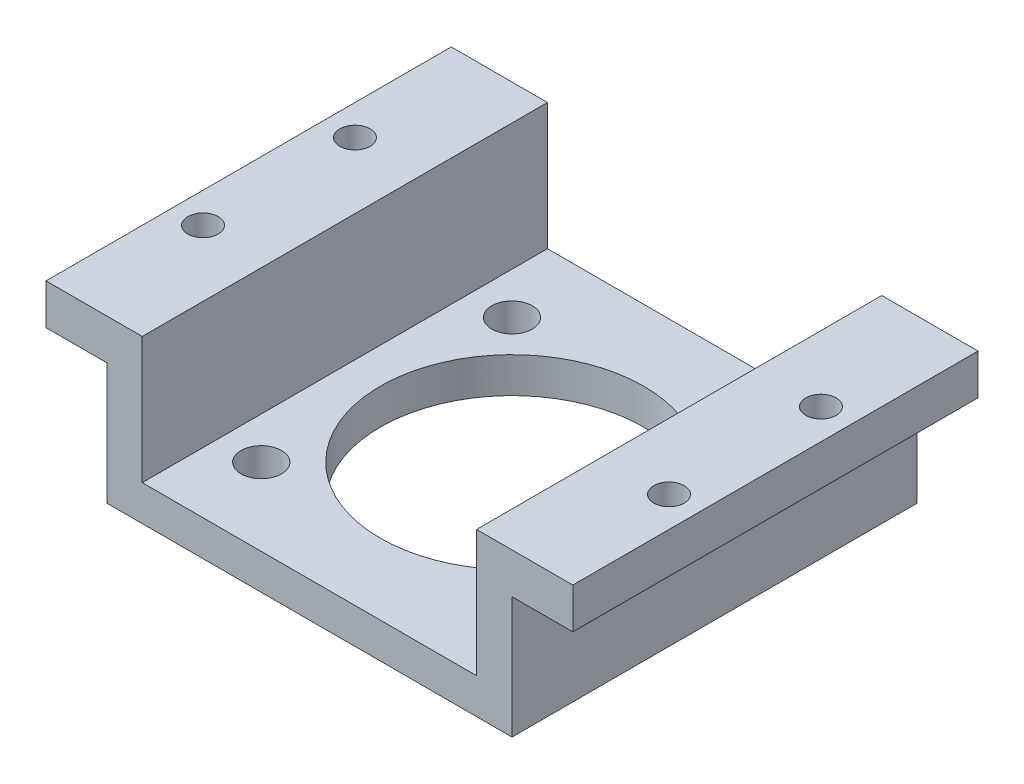
ISO-10303-21;
HEADER;
FILE_DESCRIPTION(('STEP AP214'),'2;1');
FILE_NAME('part.step','',(''),(''),'','','');
FILE_SCHEMA(('AUTOMOTIVE_DESIGN { 1 0 10303 214 1 1 1 1 }'));
ENDSEC;
DATA;
#1=APPLICATION_CONTEXT('core data for automotive mechanical design processes');
#2=APPLICATION_PROTOCOL_DEFINITION('international standard','automotive_design',2000,#1);
#3=PRODUCT_CONTEXT('',#1,'mechanical');
#4=PRODUCT('Part','Part','',(#3));
#5=PRODUCT_RELATED_PRODUCT_CATEGORY('part','',(#4));
#6=PRODUCT_DEFINITION_FORMATION('','',#4);
#7=PRODUCT_DEFINITION_CONTEXT('part definition',#1,'design');
#8=PRODUCT_DEFINITION('design','',#6,#7);
#9=PRODUCT_DEFINITION_SHAPE('','',#8);
#10=(LENGTH_UNIT() NAMED_UNIT(*) SI_UNIT(.MILLI.,.METRE.));
#11=(NAMED_UNIT(*) PLANE_ANGLE_UNIT() SI_UNIT($,.RADIAN.));
#12=(NAMED_UNIT(*) SI_UNIT($,.STERADIAN.) SOLID_ANGLE_UNIT());
#13=UNCERTAINTY_MEASURE_WITH_UNIT(LENGTH_MEASURE(1.E-05),#10,'distance_accuracy_value','');
#14=(GEOMETRIC_REPRESENTATION_CONTEXT(3) GLOBAL_UNCERTAINTY_ASSIGNED_CONTEXT((#13)) GLOBAL_UNIT_ASSIGNED_CONTEXT((#10,
#11,#12)) REPRESENTATION_CONTEXT('',''));
#15=CARTESIAN_POINT('',(0.,0.,0.));
#16=DIRECTION('',(0.,0.,1.));
#17=DIRECTION('',(1.,0.,0.));
#18=AXIS2_PLACEMENT_3D('',#15,#16,#17);
#19=CARTESIAN_POINT('',(26.,27.3987856394065,40.));
#20=DIRECTION('',(-1.,0.,0.));
#21=DIRECTION('',(0.,-1.,0.));
#22=AXIS2_PLACEMENT_3D('',#19,#20,#21);
#23=PLANE('',#22);
#24=DIRECTION('',(0.,0.,1.));
#25=VECTOR('',#24,1.);
#26=CARTESIAN_POINT('',(26.,23.3987856394065,0.));
#27=LINE('',#26,#25);
#28=CARTESIAN_POINT('',(26.,23.3987856394065,0.));
#29=VERTEX_POINT('',#28);
#30=CARTESIAN_POINT('',(26.,23.3987856394065,40.));
#31=VERTEX_POINT('',#30);
#32=EDGE_CURVE('E137',#29,#31,#27,.T.);
#33=ORIENTED_EDGE('',*,*,#32,.F.);
#34=DIRECTION('',(0.,1.,0.));
#35=VECTOR('',#34,1.);
#36=CARTESIAN_POINT('',(26.,27.3987856394065,0.));
#37=LINE('',#36,#35);
#38=CARTESIAN_POINT('',(26.,27.3987856394065,0.));
#39=VERTEX_POINT('',#38);
#40=EDGE_CURVE('E147',#29,#39,#37,.T.);
#41=ORIENTED_EDGE('',*,*,#40,.T.);
#42=DIRECTION('',(0.,0.,-1.));
#43=VECTOR('',#42,1.);
#44=CARTESIAN_POINT('',(26.,27.3987856394065,40.));
#45=LINE('',#44,#43);
#46=CARTESIAN_POINT('',(26.,27.3987856394065,40.));
#47=VERTEX_POINT('',#46);
#48=EDGE_CURVE('E191',#47,#39,#45,.T.);
#49=ORIENTED_EDGE('',*,*,#48,.F.);
#50=DIRECTION('',(0.,1.,0.));
#51=VECTOR('',#50,1.);
#52=CARTESIAN_POINT('',(26.,27.3987856394065,40.));
#53=LINE('',#52,#51);
#54=EDGE_CURVE('E149',#31,#47,#53,.T.);
#55=ORIENTED_EDGE('',*,*,#54,.F.);
#56=EDGE_LOOP('',(#33,#41,#49,#55));
#57=FACE_BOUND('',#56,.T.);
#58=ADVANCED_FACE('F40',(#57),#23,.F.);
#59=CARTESIAN_POINT('',(23.,27.3987856394065,27.5));
#60=DIRECTION('',(0.,-1.,0.));
#61=DIRECTION('',(1.,0.,0.));
#62=AXIS2_PLACEMENT_3D('',#59,#60,#61);
#63=CYLINDRICAL_SURFACE('',#62,1.5);
#64=CARTESIAN_POINT('',(23.,27.3987856394065,27.5));
#65=DIRECTION('',(0.,1.,0.));
#66=DIRECTION('',(0.,0.,-1.));
#67=AXIS2_PLACEMENT_3D('',#64,#65,#66);
#68=CIRCLE('',#67,1.5);
#69=CARTESIAN_POINT('',(23.,27.3987856394065,26.));
#70=VERTEX_POINT('',#69);
#71=EDGE_CURVE('E257',#70,#70,#68,.T.);
#72=ORIENTED_EDGE('',*,*,#71,.T.);
#73=EDGE_LOOP('',(#72));
#74=FACE_BOUND('',#73,.T.);
#75=CARTESIAN_POINT('',(23.,23.3987856394065,27.5));
#76=DIRECTION('',(0.,-1.,0.));
#77=DIRECTION('',(0.,0.,-1.));
#78=AXIS2_PLACEMENT_3D('',#75,#76,#77);
#79=CIRCLE('',#78,1.5);
#80=CARTESIAN_POINT('',(23.,23.3987856394065,26.));
#81=VERTEX_POINT('',#80);
#82=EDGE_CURVE('E374',#81,#81,#79,.T.);
#83=ORIENTED_EDGE('',*,*,#82,.T.);
#84=EDGE_LOOP('',(#83));
#85=FACE_BOUND('',#84,.T.);
#86=ADVANCED_FACE('F368',(#74,#85),#63,.F.);
#87=CARTESIAN_POINT('',(23.,27.3987856394065,12.5));
#88=DIRECTION('',(0.,-1.,0.));
#89=DIRECTION('',(1.,0.,0.));
#90=AXIS2_PLACEMENT_3D('',#87,#88,#89);
#91=CYLINDRICAL_SURFACE('',#90,1.5);
#92=CARTESIAN_POINT('',(23.,27.3987856394065,12.5));
#93=DIRECTION('',(0.,1.,0.));
#94=DIRECTION('',(0.,0.,-1.));
#95=AXIS2_PLACEMENT_3D('',#92,#93,#94);
#96=CIRCLE('',#95,1.5);
#97=CARTESIAN_POINT('',(23.,27.3987856394065,11.));
#98=VERTEX_POINT('',#97);
#99=EDGE_CURVE('E253',#98,#98,#96,.T.);
#100=ORIENTED_EDGE('',*,*,#99,.T.);
#101=EDGE_LOOP('',(#100));
#102=FACE_BOUND('',#101,.T.);
#103=CARTESIAN_POINT('',(23.,23.3987856394065,12.5));
#104=DIRECTION('',(0.,-1.,0.));
#105=DIRECTION('',(0.,0.,-1.));
#106=AXIS2_PLACEMENT_3D('',#103,#104,#105);
#107=CIRCLE('',#106,1.5);
#108=CARTESIAN_POINT('',(23.,23.3987856394065,11.));
#109=VERTEX_POINT('',#108);
#110=EDGE_CURVE('E44',#109,#109,#107,.T.);
#111=ORIENTED_EDGE('',*,*,#110,.T.);
#112=EDGE_LOOP('',(#111));
#113=FACE_BOUND('',#112,.T.);
#114=ADVANCED_FACE('F365',(#102,#113),#91,.F.);
#115=CARTESIAN_POINT('',(-26.,27.3987856394065,40.));
#116=DIRECTION('',(1.,0.,0.));
#117=DIRECTION('',(0.,0.,-1.));
#118=AXIS2_PLACEMENT_3D('',#115,#116,#117);
#119=PLANE('',#118);
#120=DIRECTION('',(0.,0.,-1.));
#121=VECTOR('',#120,1.);
#122=CARTESIAN_POINT('',(-26.,23.3987856394065,40.));
#123=LINE('',#122,#121);
#124=CARTESIAN_POINT('',(-26.,23.3987856394065,40.));
#125=VERTEX_POINT('',#124);
#126=CARTESIAN_POINT('',(-26.,23.3987856394065,0.));
#127=VERTEX_POINT('',#126);
#128=EDGE_CURVE('E66',#125,#127,#123,.T.);
#129=ORIENTED_EDGE('',*,*,#128,.F.);
#130=DIRECTION('',(0.,-1.,0.));
#131=VECTOR('',#130,1.);
#132=CARTESIAN_POINT('',(-26.,27.3987856394065,40.));
#133=LINE('',#132,#131);
#134=CARTESIAN_POINT('',(-26.,27.3987856394065,40.));
#135=VERTEX_POINT('',#134);
#136=EDGE_CURVE('E177',#135,#125,#133,.T.);
#137=ORIENTED_EDGE('',*,*,#136,.F.);
#138=DIRECTION('',(0.,0.,-1.));
#139=VECTOR('',#138,1.);
#140=CARTESIAN_POINT('',(-26.,27.3987856394065,40.));
#141=LINE('',#140,#139);
#142=CARTESIAN_POINT('',(-26.,27.3987856394065,0.));
#143=VERTEX_POINT('',#142);
#144=EDGE_CURVE('E178',#135,#143,#141,.T.);
#145=ORIENTED_EDGE('',*,*,#144,.T.);
#146=DIRECTION('',(0.,-1.,0.));
#147=VECTOR('',#146,1.);
#148=CARTESIAN_POINT('',(-26.,27.3987856394065,0.));
#149=LINE('',#148,#147);
#150=EDGE_CURVE('E288',#143,#127,#149,.T.);
#151=ORIENTED_EDGE('',*,*,#150,.T.);
#152=EDGE_LOOP('',(#129,#137,#145,#151));
#153=FACE_BOUND('',#152,.T.);
#154=ADVANCED_FACE('F42',(#153),#119,.F.);
#155=CARTESIAN_POINT('',(-23.,27.3987856394065,27.5));
#156=DIRECTION('',(0.,-1.,0.));
#157=DIRECTION('',(0.,0.,-1.));
#158=AXIS2_PLACEMENT_3D('',#155,#156,#157);
#159=CYLINDRICAL_SURFACE('',#158,1.5);
#160=CARTESIAN_POINT('',(-23.,27.3987856394065,27.5));
#161=DIRECTION('',(0.,-1.,0.));
#162=DIRECTION('',(0.,0.,-1.));
#163=AXIS2_PLACEMENT_3D('',#160,#161,#162);
#164=CIRCLE('',#163,1.5);
#165=CARTESIAN_POINT('',(-23.,27.3987856394065,26.));
#166=VERTEX_POINT('',#165);
#167=EDGE_CURVE('E265',#166,#166,#164,.T.);
#168=ORIENTED_EDGE('',*,*,#167,.F.);
#169=EDGE_LOOP('',(#168));
#170=FACE_BOUND('',#169,.T.);
#171=CARTESIAN_POINT('',(-23.,23.3987856394065,27.5));
#172=DIRECTION('',(0.,-1.,0.));
#173=DIRECTION('',(0.,0.,-1.));
#174=AXIS2_PLACEMENT_3D('',#171,#172,#173);
#175=CIRCLE('',#174,1.5);
#176=CARTESIAN_POINT('',(-23.,23.3987856394065,26.));
#177=VERTEX_POINT('',#176);
#178=EDGE_CURVE('E204',#177,#177,#175,.F.);
#179=ORIENTED_EDGE('',*,*,#178,.F.);
#180=EDGE_LOOP('',(#179));
#181=FACE_BOUND('',#180,.T.);
#182=ADVANCED_FACE('F503',(#170,#181),#159,.F.);
#183=CARTESIAN_POINT('',(-23.,27.3987856394065,12.5));
#184=DIRECTION('',(0.,-1.,0.));
#185=DIRECTION('',(0.,0.,-1.));
#186=AXIS2_PLACEMENT_3D('',#183,#184,#185);
#187=CYLINDRICAL_SURFACE('',#186,1.5);
#188=CARTESIAN_POINT('',(-23.,27.3987856394065,12.5));
#189=DIRECTION('',(0.,-1.,0.));
#190=DIRECTION('',(0.,0.,-1.));
#191=AXIS2_PLACEMENT_3D('',#188,#189,#190);
#192=CIRCLE('',#191,1.5);
#193=CARTESIAN_POINT('',(-23.,27.3987856394065,11.));
#194=VERTEX_POINT('',#193);
#195=EDGE_CURVE('E261',#194,#194,#192,.T.);
#196=ORIENTED_EDGE('',*,*,#195,.F.);
#197=EDGE_LOOP('',(#196));
#198=FACE_BOUND('',#197,.T.);
#199=CARTESIAN_POINT('',(-23.,23.3987856394065,12.5));
#200=DIRECTION('',(0.,-1.,0.));
#201=DIRECTION('',(0.,0.,-1.));
#202=AXIS2_PLACEMENT_3D('',#199,#200,#201);
#203=CIRCLE('',#202,1.5);
#204=CARTESIAN_POINT('',(-23.,23.3987856394065,11.));
#205=VERTEX_POINT('',#204);
#206=EDGE_CURVE('E201',#205,#205,#203,.F.);
#207=ORIENTED_EDGE('',*,*,#206,.F.);
#208=EDGE_LOOP('',(#207));
#209=FACE_BOUND('',#208,.T.);
#210=ADVANCED_FACE('F511',(#198,#209),#187,.F.);
#211=CARTESIAN_POINT('',(0.,12.8987856394065,20.));
#212=DIRECTION('',(0.,-1.,0.));
#213=DIRECTION('',(0.,0.,-1.));
#214=AXIS2_PLACEMENT_3D('',#211,#212,#213);
#215=CYLINDRICAL_SURFACE('',#214,13.);
#216=CARTESIAN_POINT('',(0.,11.3987856394065,20.));
#217=DIRECTION('',(0.,-1.,0.));
#218=DIRECTION('',(0.,0.,-1.));
#219=AXIS2_PLACEMENT_3D('',#216,#217,#218);
#220=CIRCLE('',#219,13.);
#221=CARTESIAN_POINT('',(0.,11.3987856394065,7.));
#222=VERTEX_POINT('',#221);
#223=EDGE_CURVE('E284',#222,#222,#220,.T.);
#224=ORIENTED_EDGE('',*,*,#223,.T.);
#225=EDGE_LOOP('',(#224));
#226=FACE_BOUND('',#225,.T.);
#227=CARTESIAN_POINT('',(0.,14.8987856394065,20.));
#228=DIRECTION('',(0.,1.,0.));
#229=DIRECTION('',(0.,0.,1.));
#230=AXIS2_PLACEMENT_3D('',#227,#228,#229);
#231=CIRCLE('',#230,13.);
#232=CARTESIAN_POINT('',(0.,14.8987856394065,33.));
#233=VERTEX_POINT('',#232);
#234=EDGE_CURVE('E249',#233,#233,#231,.F.);
#235=ORIENTED_EDGE('',*,*,#234,.F.);
#236=EDGE_LOOP('',(#235));
#237=FACE_BOUND('',#236,.T.);
#238=ADVANCED_FACE('F520',(#226,#237),#215,.F.);
#239=CARTESIAN_POINT('',(12.3743686707646,27.3997856394065,32.3743686707646));
#240=DIRECTION('',(0.,-1.,0.));
#241=DIRECTION('',(0.,0.,-1.));
#242=AXIS2_PLACEMENT_3D('',#239,#240,#241);
#243=CYLINDRICAL_SURFACE('',#242,2.);
#244=CARTESIAN_POINT('',(12.3743686707646,11.3987856394065,32.3743686707646));
#245=DIRECTION('',(0.,-1.,0.));
#246=DIRECTION('',(0.,0.,-1.));
#247=AXIS2_PLACEMENT_3D('',#244,#245,#246);
#248=CIRCLE('',#247,2.);
#249=CARTESIAN_POINT('',(12.3743686707646,11.3987856394065,30.3743686707646));
#250=VERTEX_POINT('',#249);
#251=EDGE_CURVE('E280',#250,#250,#248,.T.);
#252=ORIENTED_EDGE('',*,*,#251,.T.);
#253=EDGE_LOOP('',(#252));
#254=FACE_BOUND('',#253,.T.);
#255=CARTESIAN_POINT('',(12.3743686707646,14.8987856394065,32.3743686707646));
#256=DIRECTION('',(0.,1.,0.));
#257=DIRECTION('',(0.,0.,1.));
#258=AXIS2_PLACEMENT_3D('',#255,#256,#257);
#259=CIRCLE('',#258,2.);
#260=CARTESIAN_POINT('',(12.3743686707646,14.8987856394065,34.3743686707646));
#261=VERTEX_POINT('',#260);
#262=EDGE_CURVE('E245',#261,#261,#259,.F.);
#263=ORIENTED_EDGE('',*,*,#262,.F.);
#264=EDGE_LOOP('',(#263));
#265=FACE_BOUND('',#264,.T.);
#266=ADVANCED_FACE('F549',(#254,#265),#243,.F.);
#267=CARTESIAN_POINT('',(12.3743686707645,27.3997856394065,7.62563132923535));
#268=DIRECTION('',(0.,-1.,0.));
#269=DIRECTION('',(0.,0.,-1.));
#270=AXIS2_PLACEMENT_3D('',#267,#268,#269);
#271=CYLINDRICAL_SURFACE('',#270,2.);
#272=CARTESIAN_POINT('',(12.3743686707645,11.3987856394065,7.62563132923535));
#273=DIRECTION('',(0.,-1.,0.));
#274=DIRECTION('',(-1.,0.,0.));
#275=AXIS2_PLACEMENT_3D('',#272,#273,#274);
#276=CIRCLE('',#275,2.);
#277=CARTESIAN_POINT('',(10.3743686707645,11.3987856394065,7.62563132923536));
#278=VERTEX_POINT('',#277);
#279=EDGE_CURVE('E277',#278,#278,#276,.T.);
#280=ORIENTED_EDGE('',*,*,#279,.T.);
#281=EDGE_LOOP('',(#280));
#282=FACE_BOUND('',#281,.T.);
#283=CARTESIAN_POINT('',(12.3743686707645,14.8987856394065,7.62563132923535));
#284=DIRECTION('',(0.,1.,0.));
#285=DIRECTION('',(0.,0.,1.));
#286=AXIS2_PLACEMENT_3D('',#283,#284,#285);
#287=CIRCLE('',#286,2.);
#288=CARTESIAN_POINT('',(12.3743686707645,14.8987856394065,9.62563132923535));
#289=VERTEX_POINT('',#288);
#290=EDGE_CURVE('E241',#289,#289,#287,.F.);
#291=ORIENTED_EDGE('',*,*,#290,.F.);
#292=EDGE_LOOP('',(#291));
#293=FACE_BOUND('',#292,.T.);
#294=ADVANCED_FACE('F565',(#282,#293),#271,.F.);
#295=CARTESIAN_POINT('',(-12.3743686707646,27.3997856394065,7.62563132923544));
#296=DIRECTION('',(0.,-1.,0.));
#297=DIRECTION('',(0.,0.,-1.));
#298=AXIS2_PLACEMENT_3D('',#295,#296,#297);
#299=CYLINDRICAL_SURFACE('',#298,2.);
#300=CARTESIAN_POINT('',(-12.3743686707646,11.3987856394065,7.62563132923544));
#301=DIRECTION('',(0.,-1.,0.));
#302=DIRECTION('',(0.,0.,1.));
#303=AXIS2_PLACEMENT_3D('',#300,#301,#302);
#304=CIRCLE('',#303,2.);
#305=CARTESIAN_POINT('',(-12.3743686707646,11.3987856394065,9.62563132923544));
#306=VERTEX_POINT('',#305);
#307=EDGE_CURVE('E273',#306,#306,#304,.T.);
#308=ORIENTED_EDGE('',*,*,#307,.T.);
#309=EDGE_LOOP('',(#308));
#310=FACE_BOUND('',#309,.T.);
#311=CARTESIAN_POINT('',(-12.3743686707646,14.8987856394065,7.62563132923544));
#312=DIRECTION('',(0.,1.,0.));
#313=DIRECTION('',(0.,0.,1.));
#314=AXIS2_PLACEMENT_3D('',#311,#312,#313);
#315=CIRCLE('',#314,2.);
#316=CARTESIAN_POINT('',(-12.3743686707646,14.8987856394065,9.62563132923544));
#317=VERTEX_POINT('',#316);
#318=EDGE_CURVE('E199',#317,#317,#315,.F.);
#319=ORIENTED_EDGE('',*,*,#318,.F.);
#320=EDGE_LOOP('',(#319));
#321=FACE_BOUND('',#320,.T.);
#322=ADVANCED_FACE('F575',(#310,#321),#299,.F.);
#323=CARTESIAN_POINT('',(-12.3743686707644,27.3997856394065,32.3743686707647));
#324=DIRECTION('',(0.,-1.,0.));
#325=DIRECTION('',(0.,0.,-1.));
#326=AXIS2_PLACEMENT_3D('',#323,#324,#325);
#327=CYLINDRICAL_SURFACE('',#326,2.);
#328=CARTESIAN_POINT('',(-12.3743686707644,11.3987856394065,32.3743686707647));
#329=DIRECTION('',(0.,-1.,0.));
#330=DIRECTION('',(1.,0.,0.));
#331=AXIS2_PLACEMENT_3D('',#328,#329,#330);
#332=CIRCLE('',#331,2.);
#333=CARTESIAN_POINT('',(-10.3743686707644,11.3987856394065,32.3743686707647));
#334=VERTEX_POINT('',#333);
#335=EDGE_CURVE('E269',#334,#334,#332,.T.);
#336=ORIENTED_EDGE('',*,*,#335,.T.);
#337=EDGE_LOOP('',(#336));
#338=FACE_BOUND('',#337,.T.);
#339=CARTESIAN_POINT('',(-12.3743686707644,14.8987856394065,32.3743686707647));
#340=DIRECTION('',(0.,1.,0.));
#341=DIRECTION('',(0.,0.,1.));
#342=AXIS2_PLACEMENT_3D('',#339,#340,#341);
#343=CIRCLE('',#342,2.);
#344=CARTESIAN_POINT('',(-12.3743686707644,14.8987856394065,34.3743686707647));
#345=VERTEX_POINT('',#344);
#346=EDGE_CURVE('E196',#345,#345,#343,.F.);
#347=ORIENTED_EDGE('',*,*,#346,.F.);
#348=EDGE_LOOP('',(#347));
#349=FACE_BOUND('',#348,.T.);
#350=ADVANCED_FACE('F360',(#338,#349),#327,.F.);
#351=CARTESIAN_POINT('',(16.5,27.3987856394065,40.));
#352=DIRECTION('',(0.,-1.,0.));
#353=DIRECTION('',(0.,0.,-1.));
#354=AXIS2_PLACEMENT_3D('',#351,#352,#353);
#355=PLANE('',#354);
#356=ORIENTED_EDGE('',*,*,#71,.F.);
#357=EDGE_LOOP('',(#356));
#358=FACE_BOUND('',#357,.T.);
#359=DIRECTION('',(-1.,0.,0.));
#360=VECTOR('',#359,1.);
#361=CARTESIAN_POINT('',(16.5,27.3987856394065,0.));
#362=LINE('',#361,#360);
#363=CARTESIAN_POINT('',(16.5,27.3987856394065,0.));
#364=VERTEX_POINT('',#363);
#365=EDGE_CURVE('E156',#39,#364,#362,.T.);
#366=ORIENTED_EDGE('',*,*,#365,.T.);
#367=DIRECTION('',(0.,0.,-1.));
#368=VECTOR('',#367,1.);
#369=CARTESIAN_POINT('',(16.5,27.3987856394065,40.));
#370=LINE('',#369,#368);
#371=CARTESIAN_POINT('',(16.5,27.3987856394065,40.));
#372=VERTEX_POINT('',#371);
#373=EDGE_CURVE('E187',#372,#364,#370,.T.);
#374=ORIENTED_EDGE('',*,*,#373,.F.);
#375=DIRECTION('',(-1.,0.,0.));
#376=VECTOR('',#375,1.);
#377=CARTESIAN_POINT('',(16.5,27.3987856394065,40.));
#378=LINE('',#377,#376);
#379=EDGE_CURVE('E303',#47,#372,#378,.T.);
#380=ORIENTED_EDGE('',*,*,#379,.F.);
#381=ORIENTED_EDGE('',*,*,#48,.T.);
#382=EDGE_LOOP('',(#366,#374,#380,#381));
#383=FACE_BOUND('',#382,.T.);
#384=ORIENTED_EDGE('',*,*,#99,.F.);
#385=EDGE_LOOP('',(#384));
#386=FACE_BOUND('',#385,.T.);
#387=ADVANCED_FACE('F357',(#358,#383,#386),#355,.F.);
#388=CARTESIAN_POINT('',(-20.,21.3987856394065,40.));
#389=DIRECTION('',(1.,0.,0.));
#390=DIRECTION('',(0.,0.,-1.));
#391=AXIS2_PLACEMENT_3D('',#388,#389,#390);
#392=PLANE('',#391);
#393=DIRECTION('',(0.,-1.,0.));
#394=VECTOR('',#393,1.);
#395=CARTESIAN_POINT('',(-20.,21.3987856394065,0.));
#396=LINE('',#395,#394);
#397=CARTESIAN_POINT('',(-20.,23.3987856394065,0.));
#398=VERTEX_POINT('',#397);
#399=CARTESIAN_POINT('',(-20.,11.3987856394065,0.));
#400=VERTEX_POINT('',#399);
#401=EDGE_CURVE('E316',#398,#400,#396,.T.);
#402=ORIENTED_EDGE('',*,*,#401,.T.);
#403=DIRECTION('',(0.,0.,-1.));
#404=VECTOR('',#403,1.);
#405=CARTESIAN_POINT('',(-20.,11.3987856394065,40.));
#406=LINE('',#405,#404);
#407=CARTESIAN_POINT('',(-20.,11.3987856394065,40.));
#408=VERTEX_POINT('',#407);
#409=EDGE_CURVE('E11',#408,#400,#406,.T.);
#410=ORIENTED_EDGE('',*,*,#409,.F.);
#411=DIRECTION('',(0.,-1.,0.));
#412=VECTOR('',#411,1.);
#413=CARTESIAN_POINT('',(-20.,21.3987856394065,40.));
#414=LINE('',#413,#412);
#415=CARTESIAN_POINT('',(-20.,23.3987856394065,40.));
#416=VERTEX_POINT('',#415);
#417=EDGE_CURVE('E292',#416,#408,#414,.T.);
#418=ORIENTED_EDGE('',*,*,#417,.F.);
#419=DIRECTION('',(0.,0.,1.));
#420=VECTOR('',#419,1.);
#421=CARTESIAN_POINT('',(-20.,23.3987856394065,0.));
#422=LINE('',#421,#420);
#423=EDGE_CURVE('E215',#398,#416,#422,.T.);
#424=ORIENTED_EDGE('',*,*,#423,.F.);
#425=EDGE_LOOP('',(#402,#410,#418,#424));
#426=FACE_BOUND('',#425,.T.);
#427=ADVANCED_FACE('F331',(#426),#392,.F.);
#428=CARTESIAN_POINT('',(-20.,11.3987856394065,40.));
#429=DIRECTION('',(0.,1.,0.));
#430=DIRECTION('',(0.,0.,1.));
#431=AXIS2_PLACEMENT_3D('',#428,#429,#430);
#432=PLANE('',#431);
#433=ORIENTED_EDGE('',*,*,#335,.F.);
#434=EDGE_LOOP('',(#433));
#435=FACE_BOUND('',#434,.T.);
#436=ORIENTED_EDGE('',*,*,#307,.F.);
#437=EDGE_LOOP('',(#436));
#438=FACE_BOUND('',#437,.T.);
#439=ORIENTED_EDGE('',*,*,#279,.F.);
#440=EDGE_LOOP('',(#439));
#441=FACE_BOUND('',#440,.T.);
#442=ORIENTED_EDGE('',*,*,#251,.F.);
#443=EDGE_LOOP('',(#442));
#444=FACE_BOUND('',#443,.T.);
#445=ORIENTED_EDGE('',*,*,#223,.F.);
#446=EDGE_LOOP('',(#445));
#447=FACE_BOUND('',#446,.T.);
#448=DIRECTION('',(1.,0.,0.));
#449=VECTOR('',#448,1.);
#450=CARTESIAN_POINT('',(-20.,11.3987856394065,0.));
#451=LINE('',#450,#449);
#452=CARTESIAN_POINT('',(20.,11.3987856394065,0.));
#453=VERTEX_POINT('',#452);
#454=EDGE_CURVE('E165',#400,#453,#451,.T.);
#455=ORIENTED_EDGE('',*,*,#454,.T.);
#456=DIRECTION('',(0.,0.,-1.));
#457=VECTOR('',#456,1.);
#458=CARTESIAN_POINT('',(20.,11.3987856394065,40.));
#459=LINE('',#458,#457);
#460=CARTESIAN_POINT('',(20.,11.3987856394065,40.));
#461=VERTEX_POINT('',#460);
#462=EDGE_CURVE('E50',#461,#453,#459,.T.);
#463=ORIENTED_EDGE('',*,*,#462,.F.);
#464=DIRECTION('',(1.,0.,0.));
#465=VECTOR('',#464,1.);
#466=CARTESIAN_POINT('',(-20.,11.3987856394065,40.));
#467=LINE('',#466,#465);
#468=EDGE_CURVE('E295',#408,#461,#467,.T.);
#469=ORIENTED_EDGE('',*,*,#468,.F.);
#470=ORIENTED_EDGE('',*,*,#409,.T.);
#471=EDGE_LOOP('',(#455,#463,#469,#470));
#472=FACE_BOUND('',#471,.T.);
#473=ADVANCED_FACE('F322',(#435,#438,#441,#444,#447,#472),#432,.F.);
#474=CARTESIAN_POINT('',(20.,16.3987856394065,40.));
#475=DIRECTION('',(-1.,0.,0.));
#476=DIRECTION('',(0.,0.,1.));
#477=AXIS2_PLACEMENT_3D('',#474,#475,#476);
#478=PLANE('',#477);
#479=DIRECTION('',(0.,1.,0.));
#480=VECTOR('',#479,1.);
#481=CARTESIAN_POINT('',(20.,16.3987856394065,0.));
#482=LINE('',#481,#480);
#483=CARTESIAN_POINT('',(20.,23.3987856394065,0.));
#484=VERTEX_POINT('',#483);
#485=EDGE_CURVE('E58',#453,#484,#482,.T.);
#486=ORIENTED_EDGE('',*,*,#485,.T.);
#487=DIRECTION('',(0.,0.,-1.));
#488=VECTOR('',#487,1.);
#489=CARTESIAN_POINT('',(20.,23.3987856394065,40.));
#490=LINE('',#489,#488);
#491=CARTESIAN_POINT('',(20.,23.3987856394065,40.));
#492=VERTEX_POINT('',#491);
#493=EDGE_CURVE('E139',#492,#484,#490,.T.);
#494=ORIENTED_EDGE('',*,*,#493,.F.);
#495=DIRECTION('',(0.,1.,0.));
#496=VECTOR('',#495,1.);
#497=CARTESIAN_POINT('',(20.,16.3987856394065,40.));
#498=LINE('',#497,#496);
#499=EDGE_CURVE('E298',#461,#492,#498,.T.);
#500=ORIENTED_EDGE('',*,*,#499,.F.);
#501=ORIENTED_EDGE('',*,*,#462,.T.);
#502=EDGE_LOOP('',(#486,#494,#500,#501));
#503=FACE_BOUND('',#502,.T.);
#504=ADVANCED_FACE('F326',(#503),#478,.F.);
#505=CARTESIAN_POINT('',(16.5,16.3987856394065,40.));
#506=DIRECTION('',(1.,0.,0.));
#507=DIRECTION('',(0.,1.,0.));
#508=AXIS2_PLACEMENT_3D('',#505,#506,#507);
#509=PLANE('',#508);
#510=DIRECTION('',(0.,-1.,0.));
#511=VECTOR('',#510,1.);
#512=CARTESIAN_POINT('',(16.5,16.3987856394065,0.));
#513=LINE('',#512,#511);
#514=CARTESIAN_POINT('',(16.5,14.8987856394065,0.));
#515=VERTEX_POINT('',#514);
#516=EDGE_CURVE('E162',#364,#515,#513,.T.);
#517=ORIENTED_EDGE('',*,*,#516,.T.);
#518=DIRECTION('',(0.,0.,-1.));
#519=VECTOR('',#518,1.);
#520=CARTESIAN_POINT('',(16.5,14.8987856394065,40.));
#521=LINE('',#520,#519);
#522=CARTESIAN_POINT('',(16.5,14.8987856394065,40.));
#523=VERTEX_POINT('',#522);
#524=EDGE_CURVE('E212',#523,#515,#521,.T.);
#525=ORIENTED_EDGE('',*,*,#524,.F.);
#526=DIRECTION('',(0.,-1.,0.));
#527=VECTOR('',#526,1.);
#528=CARTESIAN_POINT('',(16.5,16.3987856394065,40.));
#529=LINE('',#528,#527);
#530=EDGE_CURVE('E305',#372,#523,#529,.T.);
#531=ORIENTED_EDGE('',*,*,#530,.F.);
#532=ORIENTED_EDGE('',*,*,#373,.T.);
#533=EDGE_LOOP('',(#517,#525,#531,#532));
#534=FACE_BOUND('',#533,.T.);
#535=ADVANCED_FACE('F353',(#534),#509,.F.);
#536=CARTESIAN_POINT('',(-16.5,27.3987856394065,40.));
#537=DIRECTION('',(-1.,0.,0.));
#538=DIRECTION('',(0.,-1.,0.));
#539=AXIS2_PLACEMENT_3D('',#536,#537,#538);
#540=PLANE('',#539);
#541=DIRECTION('',(0.,1.,0.));
#542=VECTOR('',#541,1.);
#543=CARTESIAN_POINT('',(-16.5,27.3987856394065,0.));
#544=LINE('',#543,#542);
#545=CARTESIAN_POINT('',(-16.5,14.8987856394065,0.));
#546=VERTEX_POINT('',#545);
#547=CARTESIAN_POINT('',(-16.5,27.3987856394065,0.));
#548=VERTEX_POINT('',#547);
#549=EDGE_CURVE('E171',#546,#548,#544,.T.);
#550=ORIENTED_EDGE('',*,*,#549,.T.);
#551=DIRECTION('',(0.,0.,-1.));
#552=VECTOR('',#551,1.);
#553=CARTESIAN_POINT('',(-16.5,27.3987856394065,40.));
#554=LINE('',#553,#552);
#555=CARTESIAN_POINT('',(-16.5,27.3987856394065,40.));
#556=VERTEX_POINT('',#555);
#557=EDGE_CURVE('E182',#556,#548,#554,.T.);
#558=ORIENTED_EDGE('',*,*,#557,.F.);
#559=DIRECTION('',(0.,1.,0.));
#560=VECTOR('',#559,1.);
#561=CARTESIAN_POINT('',(-16.5,27.3987856394065,40.));
#562=LINE('',#561,#560);
#563=CARTESIAN_POINT('',(-16.5,14.8987856394065,40.));
#564=VERTEX_POINT('',#563);
#565=EDGE_CURVE('E308',#564,#556,#562,.T.);
#566=ORIENTED_EDGE('',*,*,#565,.F.);
#567=DIRECTION('',(0.,0.,1.));
#568=VECTOR('',#567,1.);
#569=CARTESIAN_POINT('',(-16.5,14.8987856394065,0.));
#570=LINE('',#569,#568);
#571=EDGE_CURVE('E232',#546,#564,#570,.T.);
#572=ORIENTED_EDGE('',*,*,#571,.F.);
#573=EDGE_LOOP('',(#550,#558,#566,#572));
#574=FACE_BOUND('',#573,.T.);
#575=ADVANCED_FACE('F345',(#574),#540,.F.);
#576=CARTESIAN_POINT('',(-26.,27.3987856394065,40.));
#577=DIRECTION('',(0.,-1.,0.));
#578=DIRECTION('',(0.,0.,-1.));
#579=AXIS2_PLACEMENT_3D('',#576,#577,#578);
#580=PLANE('',#579);
#581=ORIENTED_EDGE('',*,*,#195,.T.);
#582=EDGE_LOOP('',(#581));
#583=FACE_BOUND('',#582,.T.);
#584=ORIENTED_EDGE('',*,*,#167,.T.);
#585=EDGE_LOOP('',(#584));
#586=FACE_BOUND('',#585,.T.);
#587=DIRECTION('',(-1.,0.,0.));
#588=VECTOR('',#587,1.);
#589=CARTESIAN_POINT('',(-26.,27.3987856394065,0.));
#590=LINE('',#589,#588);
#591=EDGE_CURVE('E174',#548,#143,#590,.T.);
#592=ORIENTED_EDGE('',*,*,#591,.T.);
#593=ORIENTED_EDGE('',*,*,#144,.F.);
#594=DIRECTION('',(-1.,0.,0.));
#595=VECTOR('',#594,1.);
#596=CARTESIAN_POINT('',(-26.,27.3987856394065,40.));
#597=LINE('',#596,#595);
#598=EDGE_CURVE('E183',#556,#135,#597,.T.);
#599=ORIENTED_EDGE('',*,*,#598,.F.);
#600=ORIENTED_EDGE('',*,*,#557,.T.);
#601=EDGE_LOOP('',(#592,#593,#599,#600));
#602=FACE_BOUND('',#601,.T.);
#603=ADVANCED_FACE('F340',(#583,#586,#602),#580,.F.);
#604=CARTESIAN_POINT('',(0.,0.,40.));
#605=DIRECTION('',(0.,0.,1.));
#606=DIRECTION('',(1.,0.,0.));
#607=AXIS2_PLACEMENT_3D('',#604,#605,#606);
#608=PLANE('',#607);
#609=ORIENTED_EDGE('',*,*,#499,.T.);
#610=DIRECTION('',(-1.,0.,0.));
#611=VECTOR('',#610,1.);
#612=CARTESIAN_POINT('',(26.,23.3987856394065,40.));
#613=LINE('',#612,#611);
#614=EDGE_CURVE('E151',#31,#492,#613,.T.);
#615=ORIENTED_EDGE('',*,*,#614,.F.);
#616=ORIENTED_EDGE('',*,*,#54,.T.);
#617=ORIENTED_EDGE('',*,*,#379,.T.);
#618=ORIENTED_EDGE('',*,*,#530,.T.);
#619=DIRECTION('',(1.,0.,0.));
#620=VECTOR('',#619,1.);
#621=CARTESIAN_POINT('',(-16.5,14.8987856394065,40.));
#622=LINE('',#621,#620);
#623=EDGE_CURVE('E200',#564,#523,#622,.T.);
#624=ORIENTED_EDGE('',*,*,#623,.F.);
#625=ORIENTED_EDGE('',*,*,#565,.T.);
#626=ORIENTED_EDGE('',*,*,#598,.T.);
#627=ORIENTED_EDGE('',*,*,#136,.T.);
#628=DIRECTION('',(-1.,0.,0.));
#629=VECTOR('',#628,1.);
#630=CARTESIAN_POINT('',(-20.,23.3987856394065,40.));
#631=LINE('',#630,#629);
#632=EDGE_CURVE('E205',#416,#125,#631,.T.);
#633=ORIENTED_EDGE('',*,*,#632,.F.);
#634=ORIENTED_EDGE('',*,*,#417,.T.);
#635=ORIENTED_EDGE('',*,*,#468,.T.);
#636=EDGE_LOOP('',(#609,#615,#616,#617,#618,#624,#625,#626,#627,#633,#634,#635));
#637=FACE_BOUND('',#636,.T.);
#638=ADVANCED_FACE('F328',(#637),#608,.T.);
#639=CARTESIAN_POINT('',(0.,0.,0.));
#640=DIRECTION('',(0.,0.,1.));
#641=DIRECTION('',(1.,0.,0.));
#642=AXIS2_PLACEMENT_3D('',#639,#640,#641);
#643=PLANE('',#642);
#644=DIRECTION('',(1.,0.,0.));
#645=VECTOR('',#644,1.);
#646=CARTESIAN_POINT('',(20.,23.3987856394065,0.));
#647=LINE('',#646,#645);
#648=EDGE_CURVE('E133',#484,#29,#647,.T.);
#649=ORIENTED_EDGE('',*,*,#648,.F.);
#650=ORIENTED_EDGE('',*,*,#485,.F.);
#651=ORIENTED_EDGE('',*,*,#454,.F.);
#652=ORIENTED_EDGE('',*,*,#401,.F.);
#653=DIRECTION('',(1.,0.,0.));
#654=VECTOR('',#653,1.);
#655=CARTESIAN_POINT('',(-26.,23.3987856394065,0.));
#656=LINE('',#655,#654);
#657=EDGE_CURVE('E221',#127,#398,#656,.T.);
#658=ORIENTED_EDGE('',*,*,#657,.F.);
#659=ORIENTED_EDGE('',*,*,#150,.F.);
#660=ORIENTED_EDGE('',*,*,#591,.F.);
#661=ORIENTED_EDGE('',*,*,#549,.F.);
#662=DIRECTION('',(-1.,0.,0.));
#663=VECTOR('',#662,1.);
#664=CARTESIAN_POINT('',(16.5,14.8987856394065,0.));
#665=LINE('',#664,#663);
#666=EDGE_CURVE('E228',#515,#546,#665,.T.);
#667=ORIENTED_EDGE('',*,*,#666,.F.);
#668=ORIENTED_EDGE('',*,*,#516,.F.);
#669=ORIENTED_EDGE('',*,*,#365,.F.);
#670=ORIENTED_EDGE('',*,*,#40,.F.);
#671=EDGE_LOOP('',(#649,#650,#651,#652,#658,#659,#660,#661,#667,#668,#669,#670));
#672=FACE_BOUND('',#671,.T.);
#673=ADVANCED_FACE('F154',(#672),#643,.F.);
#674=CARTESIAN_POINT('',(0.,14.8987856394065,0.));
#675=DIRECTION('',(0.,1.,0.));
#676=DIRECTION('',(0.,0.,1.));
#677=AXIS2_PLACEMENT_3D('',#674,#675,#676);
#678=PLANE('',#677);
#679=ORIENTED_EDGE('',*,*,#262,.T.);
#680=EDGE_LOOP('',(#679));
#681=FACE_BOUND('',#680,.T.);
#682=ORIENTED_EDGE('',*,*,#318,.T.);
#683=EDGE_LOOP('',(#682));
#684=FACE_BOUND('',#683,.T.);
#685=ORIENTED_EDGE('',*,*,#524,.T.);
#686=ORIENTED_EDGE('',*,*,#666,.T.);
#687=ORIENTED_EDGE('',*,*,#571,.T.);
#688=ORIENTED_EDGE('',*,*,#623,.T.);
#689=EDGE_LOOP('',(#685,#686,#687,#688));
#690=FACE_BOUND('',#689,.T.);
#691=ORIENTED_EDGE('',*,*,#346,.T.);
#692=EDGE_LOOP('',(#691));
#693=FACE_BOUND('',#692,.T.);
#694=ORIENTED_EDGE('',*,*,#290,.T.);
#695=EDGE_LOOP('',(#694));
#696=FACE_BOUND('',#695,.T.);
#697=ORIENTED_EDGE('',*,*,#234,.T.);
#698=EDGE_LOOP('',(#697));
#699=FACE_BOUND('',#698,.T.);
#700=ADVANCED_FACE('F348',(#681,#684,#690,#693,#696,#699),#678,.T.);
#701=CARTESIAN_POINT('',(0.,23.3987856394065,0.));
#702=DIRECTION('',(0.,-1.,0.));
#703=DIRECTION('',(0.,0.,-1.));
#704=AXIS2_PLACEMENT_3D('',#701,#702,#703);
#705=PLANE('',#704);
#706=ORIENTED_EDGE('',*,*,#206,.T.);
#707=EDGE_LOOP('',(#706));
#708=FACE_BOUND('',#707,.T.);
#709=ORIENTED_EDGE('',*,*,#128,.T.);
#710=ORIENTED_EDGE('',*,*,#657,.T.);
#711=ORIENTED_EDGE('',*,*,#423,.T.);
#712=ORIENTED_EDGE('',*,*,#632,.T.);
#713=EDGE_LOOP('',(#709,#710,#711,#712));
#714=FACE_BOUND('',#713,.T.);
#715=ORIENTED_EDGE('',*,*,#178,.T.);
#716=EDGE_LOOP('',(#715));
#717=FACE_BOUND('',#716,.T.);
#718=ADVANCED_FACE('F387',(#708,#714,#717),#705,.T.);
#719=CARTESIAN_POINT('',(0.,23.3987856394065,0.));
#720=DIRECTION('',(0.,-1.,0.));
#721=DIRECTION('',(0.,0.,-1.));
#722=AXIS2_PLACEMENT_3D('',#719,#720,#721);
#723=PLANE('',#722);
#724=ORIENTED_EDGE('',*,*,#82,.F.);
#725=EDGE_LOOP('',(#724));
#726=FACE_BOUND('',#725,.T.);
#727=ORIENTED_EDGE('',*,*,#110,.F.);
#728=EDGE_LOOP('',(#727));
#729=FACE_BOUND('',#728,.T.);
#730=ORIENTED_EDGE('',*,*,#493,.T.);
#731=ORIENTED_EDGE('',*,*,#648,.T.);
#732=ORIENTED_EDGE('',*,*,#32,.T.);
#733=ORIENTED_EDGE('',*,*,#614,.T.);
#734=EDGE_LOOP('',(#730,#731,#732,#733));
#735=FACE_BOUND('',#734,.T.);
#736=ADVANCED_FACE('F135',(#726,#729,#735),#723,.T.);
#737=CLOSED_SHELL('',(#58,#86,#114,#154,#182,#210,#238,#266,#294,#322,#350,#387,#427,#473,#504,
#535,#575,#603,#638,#673,#700,#718,#736));
#738=MANIFOLD_SOLID_BREP('B2',#737);
#739=ADVANCED_BREP_SHAPE_REPRESENTATION('',(#18,#738),#14);
#740=SHAPE_DEFINITION_REPRESENTATION(#9,#739);
ENDSEC;
END-ISO-10303-21;
